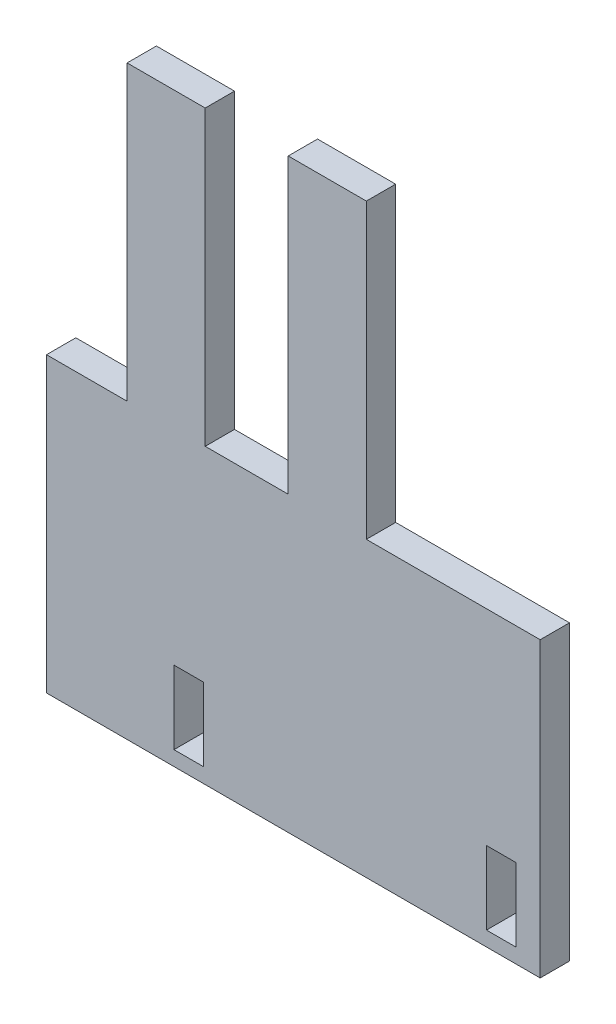
ISO-10303-21;
HEADER;
FILE_DESCRIPTION(('STEP AP214'),'2;1');
FILE_NAME('part.step','',(''),(''),'','','');
FILE_SCHEMA(('AUTOMOTIVE_DESIGN { 1 0 10303 214 1 1 1 1 }'));
ENDSEC;
DATA;
#1=APPLICATION_CONTEXT('core data for automotive mechanical design processes');
#2=APPLICATION_PROTOCOL_DEFINITION('international standard','automotive_design',2000,#1);
#3=PRODUCT_CONTEXT('',#1,'mechanical');
#4=PRODUCT('Part','Part','',(#3));
#5=PRODUCT_RELATED_PRODUCT_CATEGORY('part','',(#4));
#6=PRODUCT_DEFINITION_FORMATION('','',#4);
#7=PRODUCT_DEFINITION_CONTEXT('part definition',#1,'design');
#8=PRODUCT_DEFINITION('design','',#6,#7);
#9=PRODUCT_DEFINITION_SHAPE('','',#8);
#10=(LENGTH_UNIT() NAMED_UNIT(*) SI_UNIT(.MILLI.,.METRE.));
#11=(NAMED_UNIT(*) PLANE_ANGLE_UNIT() SI_UNIT($,.RADIAN.));
#12=(NAMED_UNIT(*) SI_UNIT($,.STERADIAN.) SOLID_ANGLE_UNIT());
#13=UNCERTAINTY_MEASURE_WITH_UNIT(LENGTH_MEASURE(1.E-05),#10,'distance_accuracy_value','');
#14=(GEOMETRIC_REPRESENTATION_CONTEXT(3) GLOBAL_UNCERTAINTY_ASSIGNED_CONTEXT((#13)) GLOBAL_UNIT_ASSIGNED_CONTEXT((#10,
#11,#12)) REPRESENTATION_CONTEXT('',''));
#15=CARTESIAN_POINT('',(0.,0.,0.));
#16=DIRECTION('',(0.,0.,1.));
#17=DIRECTION('',(1.,0.,0.));
#18=AXIS2_PLACEMENT_3D('',#15,#16,#17);
#19=CARTESIAN_POINT('',(0.,0.,6.));
#20=DIRECTION('',(0.,0.,1.));
#21=DIRECTION('',(1.,0.,0.));
#22=AXIS2_PLACEMENT_3D('',#19,#20,#21);
#23=PLANE('',#22);
#24=DIRECTION('',(-1.,0.,0.));
#25=VECTOR('',#24,1.);
#26=CARTESIAN_POINT('',(-42.4324162415231,-12.6187150837989,6.));
#27=LINE('',#26,#25);
#28=CARTESIAN_POINT('',(-42.4324162415231,-12.6187150837989,6.));
#29=VERTEX_POINT('',#28);
#30=CARTESIAN_POINT('',(-58.9324162415231,-12.6187150837989,6.));
#31=VERTEX_POINT('',#30);
#32=EDGE_CURVE('E237',#29,#31,#27,.T.);
#33=ORIENTED_EDGE('',*,*,#32,.T.);
#34=DIRECTION('',(0.,-1.,0.));
#35=VECTOR('',#34,1.);
#36=CARTESIAN_POINT('',(-58.9324162415231,-12.6187150837989,6.));
#37=LINE('',#36,#35);
#38=CARTESIAN_POINT('',(-58.9324162415231,-72.6187150837989,6.));
#39=VERTEX_POINT('',#38);
#40=EDGE_CURVE('E240',#31,#39,#37,.T.);
#41=ORIENTED_EDGE('',*,*,#40,.T.);
#42=DIRECTION('',(1.,0.,0.));
#43=VECTOR('',#42,1.);
#44=CARTESIAN_POINT('',(-58.9324162415231,-72.6187150837989,6.));
#45=LINE('',#44,#43);
#46=CARTESIAN_POINT('',(42.1675837584769,-72.6187150837989,6.));
#47=VERTEX_POINT('',#46);
#48=EDGE_CURVE('E243',#39,#47,#45,.T.);
#49=ORIENTED_EDGE('',*,*,#48,.T.);
#50=DIRECTION('',(0.,1.,0.));
#51=VECTOR('',#50,1.);
#52=CARTESIAN_POINT('',(42.1675837584769,-72.6187150837989,6.));
#53=LINE('',#52,#51);
#54=CARTESIAN_POINT('',(42.1675837584769,-12.6187150837989,6.));
#55=VERTEX_POINT('',#54);
#56=EDGE_CURVE('E245',#47,#55,#53,.T.);
#57=ORIENTED_EDGE('',*,*,#56,.T.);
#58=DIRECTION('',(-1.,0.,0.));
#59=VECTOR('',#58,1.);
#60=CARTESIAN_POINT('',(42.1675837584769,-12.6187150837989,6.));
#61=LINE('',#60,#59);
#62=CARTESIAN_POINT('',(6.56758375847687,-12.6187150837989,6.));
#63=VERTEX_POINT('',#62);
#64=EDGE_CURVE('E247',#55,#63,#61,.T.);
#65=ORIENTED_EDGE('',*,*,#64,.T.);
#66=DIRECTION('',(0.,1.,0.));
#67=VECTOR('',#66,1.);
#68=CARTESIAN_POINT('',(6.56758375847687,-12.6187150837989,6.));
#69=LINE('',#68,#67);
#70=CARTESIAN_POINT('',(6.56758375847687,47.3812849162011,6.));
#71=VERTEX_POINT('',#70);
#72=EDGE_CURVE('E249',#63,#71,#69,.T.);
#73=ORIENTED_EDGE('',*,*,#72,.T.);
#74=DIRECTION('',(-1.,0.,0.));
#75=VECTOR('',#74,1.);
#76=CARTESIAN_POINT('',(6.56758375847687,47.3812849162011,6.));
#77=LINE('',#76,#75);
#78=CARTESIAN_POINT('',(-9.43241624152313,47.3812849162011,6.));
#79=VERTEX_POINT('',#78);
#80=EDGE_CURVE('E251',#71,#79,#77,.T.);
#81=ORIENTED_EDGE('',*,*,#80,.T.);
#82=DIRECTION('',(0.,-1.,0.));
#83=VECTOR('',#82,1.);
#84=CARTESIAN_POINT('',(-9.43241624152313,47.3812849162011,6.));
#85=LINE('',#84,#83);
#86=CARTESIAN_POINT('',(-9.43241624152312,-12.6187150837989,6.));
#87=VERTEX_POINT('',#86);
#88=EDGE_CURVE('E253',#79,#87,#85,.T.);
#89=ORIENTED_EDGE('',*,*,#88,.T.);
#90=DIRECTION('',(-1.,0.,0.));
#91=VECTOR('',#90,1.);
#92=CARTESIAN_POINT('',(-9.43241624152312,-12.6187150837989,6.));
#93=LINE('',#92,#91);
#94=CARTESIAN_POINT('',(-26.4324162415231,-12.6187150837989,6.));
#95=VERTEX_POINT('',#94);
#96=EDGE_CURVE('E255',#87,#95,#93,.T.);
#97=ORIENTED_EDGE('',*,*,#96,.T.);
#98=DIRECTION('',(0.,1.,0.));
#99=VECTOR('',#98,1.);
#100=CARTESIAN_POINT('',(-26.4324162415231,-12.6187150837989,6.));
#101=LINE('',#100,#99);
#102=CARTESIAN_POINT('',(-26.4324162415231,47.3812849162011,6.));
#103=VERTEX_POINT('',#102);
#104=EDGE_CURVE('E257',#95,#103,#101,.T.);
#105=ORIENTED_EDGE('',*,*,#104,.T.);
#106=DIRECTION('',(-1.,0.,0.));
#107=VECTOR('',#106,1.);
#108=CARTESIAN_POINT('',(-26.4324162415231,47.3812849162011,6.));
#109=LINE('',#108,#107);
#110=CARTESIAN_POINT('',(-42.4324162415231,47.3812849162011,6.));
#111=VERTEX_POINT('',#110);
#112=EDGE_CURVE('E259',#103,#111,#109,.T.);
#113=ORIENTED_EDGE('',*,*,#112,.T.);
#114=DIRECTION('',(0.,-1.,0.));
#115=VECTOR('',#114,1.);
#116=CARTESIAN_POINT('',(-42.4324162415231,47.3812849162011,6.));
#117=LINE('',#116,#115);
#118=EDGE_CURVE('E261',#111,#29,#117,.T.);
#119=ORIENTED_EDGE('',*,*,#118,.T.);
#120=EDGE_LOOP('',(#33,#41,#49,#57,#65,#73,#81,#89,#97,#105,#113,#119));
#121=FACE_BOUND('',#120,.T.);
#122=DIRECTION('',(-1.,0.,0.));
#123=VECTOR('',#122,1.);
#124=CARTESIAN_POINT('',(37.1675837584769,-54.6187150837989,6.));
#125=LINE('',#124,#123);
#126=CARTESIAN_POINT('',(37.1675837584769,-54.6187150837989,6.));
#127=VERTEX_POINT('',#126);
#128=CARTESIAN_POINT('',(31.1675837584769,-54.6187150837989,6.));
#129=VERTEX_POINT('',#128);
#130=EDGE_CURVE('E208',#127,#129,#125,.T.);
#131=ORIENTED_EDGE('',*,*,#130,.F.);
#132=DIRECTION('',(0.,1.,0.));
#133=VECTOR('',#132,1.);
#134=CARTESIAN_POINT('',(37.1675837584769,-54.6187150837989,6.));
#135=LINE('',#134,#133);
#136=CARTESIAN_POINT('',(37.1675837584769,-69.6187150837989,6.));
#137=VERTEX_POINT('',#136);
#138=EDGE_CURVE('E206',#137,#127,#135,.T.);
#139=ORIENTED_EDGE('',*,*,#138,.F.);
#140=DIRECTION('',(1.,0.,0.));
#141=VECTOR('',#140,1.);
#142=CARTESIAN_POINT('',(37.1675837584769,-69.6187150837989,6.));
#143=LINE('',#142,#141);
#144=CARTESIAN_POINT('',(31.1675837584769,-69.6187150837989,6.));
#145=VERTEX_POINT('',#144);
#146=EDGE_CURVE('E214',#145,#137,#143,.T.);
#147=ORIENTED_EDGE('',*,*,#146,.F.);
#148=DIRECTION('',(0.,-1.,0.));
#149=VECTOR('',#148,1.);
#150=CARTESIAN_POINT('',(31.1675837584769,-54.6187150837989,6.));
#151=LINE('',#150,#149);
#152=EDGE_CURVE('E211',#129,#145,#151,.T.);
#153=ORIENTED_EDGE('',*,*,#152,.F.);
#154=EDGE_LOOP('',(#131,#139,#147,#153));
#155=FACE_BOUND('',#154,.T.);
#156=DIRECTION('',(-1.,0.,0.));
#157=VECTOR('',#156,1.);
#158=CARTESIAN_POINT('',(-26.8324162415231,-54.6187150837989,6.));
#159=LINE('',#158,#157);
#160=CARTESIAN_POINT('',(-26.8324162415231,-54.6187150837989,6.));
#161=VERTEX_POINT('',#160);
#162=CARTESIAN_POINT('',(-32.8324162415231,-54.6187150837989,6.));
#163=VERTEX_POINT('',#162);
#164=EDGE_CURVE('E178',#161,#163,#159,.T.);
#165=ORIENTED_EDGE('',*,*,#164,.F.);
#166=DIRECTION('',(0.,1.,0.));
#167=VECTOR('',#166,1.);
#168=CARTESIAN_POINT('',(-26.8324162415231,-54.6187150837989,6.));
#169=LINE('',#168,#167);
#170=CARTESIAN_POINT('',(-26.8324162415231,-69.6187150837989,6.));
#171=VERTEX_POINT('',#170);
#172=EDGE_CURVE('E170',#171,#161,#169,.T.);
#173=ORIENTED_EDGE('',*,*,#172,.F.);
#174=DIRECTION('',(1.,0.,0.));
#175=VECTOR('',#174,1.);
#176=CARTESIAN_POINT('',(-26.8324162415231,-69.6187150837989,6.));
#177=LINE('',#176,#175);
#178=CARTESIAN_POINT('',(-32.8324162415231,-69.6187150837989,6.));
#179=VERTEX_POINT('',#178);
#180=EDGE_CURVE('E192',#179,#171,#177,.T.);
#181=ORIENTED_EDGE('',*,*,#180,.F.);
#182=DIRECTION('',(0.,-1.,0.));
#183=VECTOR('',#182,1.);
#184=CARTESIAN_POINT('',(-32.8324162415231,-54.6187150837989,6.));
#185=LINE('',#184,#183);
#186=EDGE_CURVE('E190',#163,#179,#185,.T.);
#187=ORIENTED_EDGE('',*,*,#186,.F.);
#188=EDGE_LOOP('',(#165,#173,#181,#187));
#189=FACE_BOUND('',#188,.T.);
#190=ADVANCED_FACE('F33',(#121,#155,#189),#23,.T.);
#191=CARTESIAN_POINT('',(0.,0.,0.));
#192=DIRECTION('',(0.,0.,1.));
#193=DIRECTION('',(1.,0.,0.));
#194=AXIS2_PLACEMENT_3D('',#191,#192,#193);
#195=PLANE('',#194);
#196=DIRECTION('',(0.,1.,0.));
#197=VECTOR('',#196,1.);
#198=CARTESIAN_POINT('',(37.1675837584769,-54.6187150837989,0.));
#199=LINE('',#198,#197);
#200=CARTESIAN_POINT('',(37.1675837584769,-69.6187150837989,0.));
#201=VERTEX_POINT('',#200);
#202=CARTESIAN_POINT('',(37.1675837584769,-54.6187150837989,0.));
#203=VERTEX_POINT('',#202);
#204=EDGE_CURVE('E186',#201,#203,#199,.T.);
#205=ORIENTED_EDGE('',*,*,#204,.T.);
#206=DIRECTION('',(-1.,0.,0.));
#207=VECTOR('',#206,1.);
#208=CARTESIAN_POINT('',(37.1675837584769,-54.6187150837989,0.));
#209=LINE('',#208,#207);
#210=CARTESIAN_POINT('',(31.1675837584769,-54.6187150837989,0.));
#211=VERTEX_POINT('',#210);
#212=EDGE_CURVE('E219',#203,#211,#209,.T.);
#213=ORIENTED_EDGE('',*,*,#212,.T.);
#214=DIRECTION('',(0.,-1.,0.));
#215=VECTOR('',#214,1.);
#216=CARTESIAN_POINT('',(31.1675837584769,-54.6187150837989,0.));
#217=LINE('',#216,#215);
#218=CARTESIAN_POINT('',(31.1675837584769,-69.6187150837989,0.));
#219=VERTEX_POINT('',#218);
#220=EDGE_CURVE('E222',#211,#219,#217,.T.);
#221=ORIENTED_EDGE('',*,*,#220,.T.);
#222=DIRECTION('',(1.,0.,0.));
#223=VECTOR('',#222,1.);
#224=CARTESIAN_POINT('',(37.1675837584769,-69.6187150837989,0.));
#225=LINE('',#224,#223);
#226=EDGE_CURVE('E209',#219,#201,#225,.T.);
#227=ORIENTED_EDGE('',*,*,#226,.T.);
#228=EDGE_LOOP('',(#205,#213,#221,#227));
#229=FACE_BOUND('',#228,.T.);
#230=DIRECTION('',(-1.,0.,0.));
#231=VECTOR('',#230,1.);
#232=CARTESIAN_POINT('',(-42.4324162415231,-12.6187150837989,0.));
#233=LINE('',#232,#231);
#234=CARTESIAN_POINT('',(-42.4324162415231,-12.6187150837989,0.));
#235=VERTEX_POINT('',#234);
#236=CARTESIAN_POINT('',(-58.9324162415231,-12.6187150837989,0.));
#237=VERTEX_POINT('',#236);
#238=EDGE_CURVE('E236',#235,#237,#233,.T.);
#239=ORIENTED_EDGE('',*,*,#238,.F.);
#240=DIRECTION('',(0.,-1.,0.));
#241=VECTOR('',#240,1.);
#242=CARTESIAN_POINT('',(-42.4324162415231,47.3812849162011,0.));
#243=LINE('',#242,#241);
#244=CARTESIAN_POINT('',(-42.4324162415231,47.3812849162011,0.));
#245=VERTEX_POINT('',#244);
#246=EDGE_CURVE('E241',#245,#235,#243,.T.);
#247=ORIENTED_EDGE('',*,*,#246,.F.);
#248=DIRECTION('',(-1.,0.,0.));
#249=VECTOR('',#248,1.);
#250=CARTESIAN_POINT('',(-26.4324162415231,47.3812849162011,0.));
#251=LINE('',#250,#249);
#252=CARTESIAN_POINT('',(-26.4324162415231,47.3812849162011,0.));
#253=VERTEX_POINT('',#252);
#254=EDGE_CURVE('E284',#253,#245,#251,.T.);
#255=ORIENTED_EDGE('',*,*,#254,.F.);
#256=DIRECTION('',(0.,1.,0.));
#257=VECTOR('',#256,1.);
#258=CARTESIAN_POINT('',(-26.4324162415231,-12.6187150837989,0.));
#259=LINE('',#258,#257);
#260=CARTESIAN_POINT('',(-26.4324162415231,-12.6187150837989,0.));
#261=VERTEX_POINT('',#260);
#262=EDGE_CURVE('E282',#261,#253,#259,.T.);
#263=ORIENTED_EDGE('',*,*,#262,.F.);
#264=DIRECTION('',(-1.,0.,0.));
#265=VECTOR('',#264,1.);
#266=CARTESIAN_POINT('',(-9.43241624152312,-12.6187150837989,0.));
#267=LINE('',#266,#265);
#268=CARTESIAN_POINT('',(-9.43241624152312,-12.6187150837989,0.));
#269=VERTEX_POINT('',#268);
#270=EDGE_CURVE('E280',#269,#261,#267,.T.);
#271=ORIENTED_EDGE('',*,*,#270,.F.);
#272=DIRECTION('',(0.,-1.,0.));
#273=VECTOR('',#272,1.);
#274=CARTESIAN_POINT('',(-9.43241624152313,47.3812849162011,0.));
#275=LINE('',#274,#273);
#276=CARTESIAN_POINT('',(-9.43241624152313,47.3812849162011,0.));
#277=VERTEX_POINT('',#276);
#278=EDGE_CURVE('E278',#277,#269,#275,.T.);
#279=ORIENTED_EDGE('',*,*,#278,.F.);
#280=DIRECTION('',(-1.,0.,0.));
#281=VECTOR('',#280,1.);
#282=CARTESIAN_POINT('',(6.56758375847687,47.3812849162011,0.));
#283=LINE('',#282,#281);
#284=CARTESIAN_POINT('',(6.56758375847687,47.3812849162011,0.));
#285=VERTEX_POINT('',#284);
#286=EDGE_CURVE('E276',#285,#277,#283,.T.);
#287=ORIENTED_EDGE('',*,*,#286,.F.);
#288=DIRECTION('',(0.,1.,0.));
#289=VECTOR('',#288,1.);
#290=CARTESIAN_POINT('',(6.56758375847687,-12.6187150837989,0.));
#291=LINE('',#290,#289);
#292=CARTESIAN_POINT('',(6.56758375847687,-12.6187150837989,0.));
#293=VERTEX_POINT('',#292);
#294=EDGE_CURVE('E274',#293,#285,#291,.T.);
#295=ORIENTED_EDGE('',*,*,#294,.F.);
#296=DIRECTION('',(-1.,0.,0.));
#297=VECTOR('',#296,1.);
#298=CARTESIAN_POINT('',(42.1675837584769,-12.6187150837989,0.));
#299=LINE('',#298,#297);
#300=CARTESIAN_POINT('',(42.1675837584769,-12.6187150837989,0.));
#301=VERTEX_POINT('',#300);
#302=EDGE_CURVE('E272',#301,#293,#299,.T.);
#303=ORIENTED_EDGE('',*,*,#302,.F.);
#304=DIRECTION('',(0.,1.,0.));
#305=VECTOR('',#304,1.);
#306=CARTESIAN_POINT('',(42.1675837584769,-72.6187150837989,0.));
#307=LINE('',#306,#305);
#308=CARTESIAN_POINT('',(42.1675837584769,-72.6187150837989,0.));
#309=VERTEX_POINT('',#308);
#310=EDGE_CURVE('E270',#309,#301,#307,.T.);
#311=ORIENTED_EDGE('',*,*,#310,.F.);
#312=DIRECTION('',(1.,0.,0.));
#313=VECTOR('',#312,1.);
#314=CARTESIAN_POINT('',(-58.9324162415231,-72.6187150837989,0.));
#315=LINE('',#314,#313);
#316=CARTESIAN_POINT('',(-58.9324162415231,-72.6187150837989,0.));
#317=VERTEX_POINT('',#316);
#318=EDGE_CURVE('E268',#317,#309,#315,.T.);
#319=ORIENTED_EDGE('',*,*,#318,.F.);
#320=DIRECTION('',(0.,-1.,0.));
#321=VECTOR('',#320,1.);
#322=CARTESIAN_POINT('',(-58.9324162415231,-12.6187150837989,0.));
#323=LINE('',#322,#321);
#324=EDGE_CURVE('E266',#237,#317,#323,.T.);
#325=ORIENTED_EDGE('',*,*,#324,.F.);
#326=EDGE_LOOP('',(#239,#247,#255,#263,#271,#279,#287,#295,#303,#311,#319,#325));
#327=FACE_BOUND('',#326,.T.);
#328=DIRECTION('',(0.,1.,0.));
#329=VECTOR('',#328,1.);
#330=CARTESIAN_POINT('',(-26.8324162415231,-54.6187150837989,0.));
#331=LINE('',#330,#329);
#332=CARTESIAN_POINT('',(-26.8324162415231,-69.6187150837989,0.));
#333=VERTEX_POINT('',#332);
#334=CARTESIAN_POINT('',(-26.8324162415231,-54.6187150837989,0.));
#335=VERTEX_POINT('',#334);
#336=EDGE_CURVE('E56',#333,#335,#331,.T.);
#337=ORIENTED_EDGE('',*,*,#336,.T.);
#338=DIRECTION('',(-1.,0.,0.));
#339=VECTOR('',#338,1.);
#340=CARTESIAN_POINT('',(-26.8324162415231,-54.6187150837989,0.));
#341=LINE('',#340,#339);
#342=CARTESIAN_POINT('',(-32.8324162415231,-54.6187150837989,0.));
#343=VERTEX_POINT('',#342);
#344=EDGE_CURVE('E185',#335,#343,#341,.T.);
#345=ORIENTED_EDGE('',*,*,#344,.T.);
#346=DIRECTION('',(0.,-1.,0.));
#347=VECTOR('',#346,1.);
#348=CARTESIAN_POINT('',(-32.8324162415231,-54.6187150837989,0.));
#349=LINE('',#348,#347);
#350=CARTESIAN_POINT('',(-32.8324162415231,-69.6187150837989,0.));
#351=VERTEX_POINT('',#350);
#352=EDGE_CURVE('E198',#343,#351,#349,.T.);
#353=ORIENTED_EDGE('',*,*,#352,.T.);
#354=DIRECTION('',(1.,0.,0.));
#355=VECTOR('',#354,1.);
#356=CARTESIAN_POINT('',(-26.8324162415231,-69.6187150837989,0.));
#357=LINE('',#356,#355);
#358=EDGE_CURVE('E179',#351,#333,#357,.T.);
#359=ORIENTED_EDGE('',*,*,#358,.T.);
#360=EDGE_LOOP('',(#337,#345,#353,#359));
#361=FACE_BOUND('',#360,.T.);
#362=ADVANCED_FACE('F326',(#229,#327,#361),#195,.F.);
#363=CARTESIAN_POINT('',(-42.4324162415231,-12.6187150837989,6.));
#364=DIRECTION('',(0.,-1.,0.));
#365=DIRECTION('',(1.,0.,0.));
#366=AXIS2_PLACEMENT_3D('',#363,#364,#365);
#367=PLANE('',#366);
#368=ORIENTED_EDGE('',*,*,#238,.T.);
#369=DIRECTION('',(0.,0.,-1.));
#370=VECTOR('',#369,1.);
#371=CARTESIAN_POINT('',(-58.9324162415231,-12.6187150837989,6.));
#372=LINE('',#371,#370);
#373=EDGE_CURVE('E11',#31,#237,#372,.T.);
#374=ORIENTED_EDGE('',*,*,#373,.F.);
#375=ORIENTED_EDGE('',*,*,#32,.F.);
#376=DIRECTION('',(0.,0.,-1.));
#377=VECTOR('',#376,1.);
#378=CARTESIAN_POINT('',(-42.4324162415231,-12.6187150837989,6.));
#379=LINE('',#378,#377);
#380=EDGE_CURVE('E263',#29,#235,#379,.T.);
#381=ORIENTED_EDGE('',*,*,#380,.T.);
#382=EDGE_LOOP('',(#368,#374,#375,#381));
#383=FACE_BOUND('',#382,.T.);
#384=ADVANCED_FACE('F35',(#383),#367,.F.);
#385=CARTESIAN_POINT('',(-58.9324162415231,-12.6187150837989,6.));
#386=DIRECTION('',(1.,0.,0.));
#387=DIRECTION('',(0.,1.,0.));
#388=AXIS2_PLACEMENT_3D('',#385,#386,#387);
#389=PLANE('',#388);
#390=ORIENTED_EDGE('',*,*,#324,.T.);
#391=DIRECTION('',(0.,0.,-1.));
#392=VECTOR('',#391,1.);
#393=CARTESIAN_POINT('',(-58.9324162415231,-72.6187150837989,6.));
#394=LINE('',#393,#392);
#395=EDGE_CURVE('E41',#39,#317,#394,.T.);
#396=ORIENTED_EDGE('',*,*,#395,.F.);
#397=ORIENTED_EDGE('',*,*,#40,.F.);
#398=ORIENTED_EDGE('',*,*,#373,.T.);
#399=EDGE_LOOP('',(#390,#396,#397,#398));
#400=FACE_BOUND('',#399,.T.);
#401=ADVANCED_FACE('F344',(#400),#389,.F.);
#402=CARTESIAN_POINT('',(-58.9324162415231,-72.6187150837989,6.));
#403=DIRECTION('',(0.,1.,0.));
#404=DIRECTION('',(0.,0.,1.));
#405=AXIS2_PLACEMENT_3D('',#402,#403,#404);
#406=PLANE('',#405);
#407=ORIENTED_EDGE('',*,*,#318,.T.);
#408=DIRECTION('',(0.,0.,-1.));
#409=VECTOR('',#408,1.);
#410=CARTESIAN_POINT('',(42.1675837584769,-72.6187150837989,6.));
#411=LINE('',#410,#409);
#412=EDGE_CURVE('E313',#47,#309,#411,.T.);
#413=ORIENTED_EDGE('',*,*,#412,.F.);
#414=ORIENTED_EDGE('',*,*,#48,.F.);
#415=ORIENTED_EDGE('',*,*,#395,.T.);
#416=EDGE_LOOP('',(#407,#413,#414,#415));
#417=FACE_BOUND('',#416,.T.);
#418=ADVANCED_FACE('F320',(#417),#406,.F.);
#419=CARTESIAN_POINT('',(42.1675837584769,-72.6187150837989,6.));
#420=DIRECTION('',(-1.,0.,0.));
#421=DIRECTION('',(0.,0.,1.));
#422=AXIS2_PLACEMENT_3D('',#419,#420,#421);
#423=PLANE('',#422);
#424=ORIENTED_EDGE('',*,*,#310,.T.);
#425=DIRECTION('',(0.,0.,-1.));
#426=VECTOR('',#425,1.);
#427=CARTESIAN_POINT('',(42.1675837584769,-12.6187150837989,6.));
#428=LINE('',#427,#426);
#429=EDGE_CURVE('E310',#55,#301,#428,.T.);
#430=ORIENTED_EDGE('',*,*,#429,.F.);
#431=ORIENTED_EDGE('',*,*,#56,.F.);
#432=ORIENTED_EDGE('',*,*,#412,.T.);
#433=EDGE_LOOP('',(#424,#430,#431,#432));
#434=FACE_BOUND('',#433,.T.);
#435=ADVANCED_FACE('F332',(#434),#423,.F.);
#436=CARTESIAN_POINT('',(42.1675837584769,-12.6187150837989,6.));
#437=DIRECTION('',(0.,-1.,0.));
#438=DIRECTION('',(1.,0.,0.));
#439=AXIS2_PLACEMENT_3D('',#436,#437,#438);
#440=PLANE('',#439);
#441=ORIENTED_EDGE('',*,*,#302,.T.);
#442=DIRECTION('',(0.,0.,-1.));
#443=VECTOR('',#442,1.);
#444=CARTESIAN_POINT('',(6.56758375847687,-12.6187150837989,6.));
#445=LINE('',#444,#443);
#446=EDGE_CURVE('E307',#63,#293,#445,.T.);
#447=ORIENTED_EDGE('',*,*,#446,.F.);
#448=ORIENTED_EDGE('',*,*,#64,.F.);
#449=ORIENTED_EDGE('',*,*,#429,.T.);
#450=EDGE_LOOP('',(#441,#447,#448,#449));
#451=FACE_BOUND('',#450,.T.);
#452=ADVANCED_FACE('F336',(#451),#440,.F.);
#453=CARTESIAN_POINT('',(6.56758375847687,-12.6187150837989,6.));
#454=DIRECTION('',(-1.,0.,0.));
#455=DIRECTION('',(0.,0.,1.));
#456=AXIS2_PLACEMENT_3D('',#453,#454,#455);
#457=PLANE('',#456);
#458=ORIENTED_EDGE('',*,*,#294,.T.);
#459=DIRECTION('',(0.,0.,-1.));
#460=VECTOR('',#459,1.);
#461=CARTESIAN_POINT('',(6.56758375847687,47.3812849162011,6.));
#462=LINE('',#461,#460);
#463=EDGE_CURVE('E304',#71,#285,#462,.T.);
#464=ORIENTED_EDGE('',*,*,#463,.F.);
#465=ORIENTED_EDGE('',*,*,#72,.F.);
#466=ORIENTED_EDGE('',*,*,#446,.T.);
#467=EDGE_LOOP('',(#458,#464,#465,#466));
#468=FACE_BOUND('',#467,.T.);
#469=ADVANCED_FACE('F377',(#468),#457,.F.);
#470=CARTESIAN_POINT('',(6.56758375847687,47.3812849162011,6.));
#471=DIRECTION('',(0.,-1.,0.));
#472=DIRECTION('',(0.,0.,-1.));
#473=AXIS2_PLACEMENT_3D('',#470,#471,#472);
#474=PLANE('',#473);
#475=ORIENTED_EDGE('',*,*,#286,.T.);
#476=DIRECTION('',(0.,0.,-1.));
#477=VECTOR('',#476,1.);
#478=CARTESIAN_POINT('',(-9.43241624152313,47.3812849162011,6.));
#479=LINE('',#478,#477);
#480=EDGE_CURVE('E301',#79,#277,#479,.T.);
#481=ORIENTED_EDGE('',*,*,#480,.F.);
#482=ORIENTED_EDGE('',*,*,#80,.F.);
#483=ORIENTED_EDGE('',*,*,#463,.T.);
#484=EDGE_LOOP('',(#475,#481,#482,#483));
#485=FACE_BOUND('',#484,.T.);
#486=ADVANCED_FACE('F375',(#485),#474,.F.);
#487=CARTESIAN_POINT('',(-9.43241624152313,47.3812849162011,6.));
#488=DIRECTION('',(1.,0.,0.));
#489=DIRECTION('',(0.,1.,0.));
#490=AXIS2_PLACEMENT_3D('',#487,#488,#489);
#491=PLANE('',#490);
#492=ORIENTED_EDGE('',*,*,#278,.T.);
#493=DIRECTION('',(0.,0.,-1.));
#494=VECTOR('',#493,1.);
#495=CARTESIAN_POINT('',(-9.43241624152312,-12.6187150837989,6.));
#496=LINE('',#495,#494);
#497=EDGE_CURVE('E298',#87,#269,#496,.T.);
#498=ORIENTED_EDGE('',*,*,#497,.F.);
#499=ORIENTED_EDGE('',*,*,#88,.F.);
#500=ORIENTED_EDGE('',*,*,#480,.T.);
#501=EDGE_LOOP('',(#492,#498,#499,#500));
#502=FACE_BOUND('',#501,.T.);
#503=ADVANCED_FACE('F371',(#502),#491,.F.);
#504=CARTESIAN_POINT('',(-9.43241624152312,-12.6187150837989,6.));
#505=DIRECTION('',(0.,-1.,0.));
#506=DIRECTION('',(1.,0.,0.));
#507=AXIS2_PLACEMENT_3D('',#504,#505,#506);
#508=PLANE('',#507);
#509=ORIENTED_EDGE('',*,*,#270,.T.);
#510=DIRECTION('',(0.,0.,-1.));
#511=VECTOR('',#510,1.);
#512=CARTESIAN_POINT('',(-26.4324162415231,-12.6187150837989,6.));
#513=LINE('',#512,#511);
#514=EDGE_CURVE('E295',#95,#261,#513,.T.);
#515=ORIENTED_EDGE('',*,*,#514,.F.);
#516=ORIENTED_EDGE('',*,*,#96,.F.);
#517=ORIENTED_EDGE('',*,*,#497,.T.);
#518=EDGE_LOOP('',(#509,#515,#516,#517));
#519=FACE_BOUND('',#518,.T.);
#520=ADVANCED_FACE('F366',(#519),#508,.F.);
#521=CARTESIAN_POINT('',(-26.4324162415231,-12.6187150837989,6.));
#522=DIRECTION('',(-1.,0.,0.));
#523=DIRECTION('',(0.,-1.,0.));
#524=AXIS2_PLACEMENT_3D('',#521,#522,#523);
#525=PLANE('',#524);
#526=ORIENTED_EDGE('',*,*,#262,.T.);
#527=DIRECTION('',(0.,0.,-1.));
#528=VECTOR('',#527,1.);
#529=CARTESIAN_POINT('',(-26.4324162415231,47.3812849162011,6.));
#530=LINE('',#529,#528);
#531=EDGE_CURVE('E292',#103,#253,#530,.T.);
#532=ORIENTED_EDGE('',*,*,#531,.F.);
#533=ORIENTED_EDGE('',*,*,#104,.F.);
#534=ORIENTED_EDGE('',*,*,#514,.T.);
#535=EDGE_LOOP('',(#526,#532,#533,#534));
#536=FACE_BOUND('',#535,.T.);
#537=ADVANCED_FACE('F360',(#536),#525,.F.);
#538=CARTESIAN_POINT('',(-26.4324162415231,47.3812849162011,6.));
#539=DIRECTION('',(0.,-1.,0.));
#540=DIRECTION('',(0.,0.,-1.));
#541=AXIS2_PLACEMENT_3D('',#538,#539,#540);
#542=PLANE('',#541);
#543=ORIENTED_EDGE('',*,*,#254,.T.);
#544=DIRECTION('',(0.,0.,-1.));
#545=VECTOR('',#544,1.);
#546=CARTESIAN_POINT('',(-42.4324162415231,47.3812849162011,6.));
#547=LINE('',#546,#545);
#548=EDGE_CURVE('E289',#111,#245,#547,.T.);
#549=ORIENTED_EDGE('',*,*,#548,.F.);
#550=ORIENTED_EDGE('',*,*,#112,.F.);
#551=ORIENTED_EDGE('',*,*,#531,.T.);
#552=EDGE_LOOP('',(#543,#549,#550,#551));
#553=FACE_BOUND('',#552,.T.);
#554=ADVANCED_FACE('F356',(#553),#542,.F.);
#555=CARTESIAN_POINT('',(-42.4324162415231,47.3812849162011,6.));
#556=DIRECTION('',(1.,0.,0.));
#557=DIRECTION('',(0.,1.,0.));
#558=AXIS2_PLACEMENT_3D('',#555,#556,#557);
#559=PLANE('',#558);
#560=ORIENTED_EDGE('',*,*,#246,.T.);
#561=ORIENTED_EDGE('',*,*,#380,.F.);
#562=ORIENTED_EDGE('',*,*,#118,.F.);
#563=ORIENTED_EDGE('',*,*,#548,.T.);
#564=EDGE_LOOP('',(#560,#561,#562,#563));
#565=FACE_BOUND('',#564,.T.);
#566=ADVANCED_FACE('F351',(#565),#559,.F.);
#567=CARTESIAN_POINT('',(37.1675837584769,-54.6187150837989,6.));
#568=DIRECTION('',(-1.,0.,0.));
#569=DIRECTION('',(0.,0.,1.));
#570=AXIS2_PLACEMENT_3D('',#567,#568,#569);
#571=PLANE('',#570);
#572=ORIENTED_EDGE('',*,*,#204,.F.);
#573=DIRECTION('',(0.,0.,-1.));
#574=VECTOR('',#573,1.);
#575=CARTESIAN_POINT('',(37.1675837584769,-69.6187150837989,6.));
#576=LINE('',#575,#574);
#577=EDGE_CURVE('E216',#137,#201,#576,.T.);
#578=ORIENTED_EDGE('',*,*,#577,.F.);
#579=ORIENTED_EDGE('',*,*,#138,.T.);
#580=DIRECTION('',(0.,0.,-1.));
#581=VECTOR('',#580,1.);
#582=CARTESIAN_POINT('',(37.1675837584769,-54.6187150837989,6.));
#583=LINE('',#582,#581);
#584=EDGE_CURVE('E233',#127,#203,#583,.T.);
#585=ORIENTED_EDGE('',*,*,#584,.T.);
#586=EDGE_LOOP('',(#572,#578,#579,#585));
#587=FACE_BOUND('',#586,.T.);
#588=ADVANCED_FACE('F394',(#587),#571,.T.);
#589=CARTESIAN_POINT('',(37.1675837584769,-54.6187150837989,6.));
#590=DIRECTION('',(0.,-1.,0.));
#591=DIRECTION('',(0.,0.,-1.));
#592=AXIS2_PLACEMENT_3D('',#589,#590,#591);
#593=PLANE('',#592);
#594=ORIENTED_EDGE('',*,*,#212,.F.);
#595=ORIENTED_EDGE('',*,*,#584,.F.);
#596=ORIENTED_EDGE('',*,*,#130,.T.);
#597=DIRECTION('',(0.,0.,-1.));
#598=VECTOR('',#597,1.);
#599=CARTESIAN_POINT('',(31.1675837584769,-54.6187150837989,6.));
#600=LINE('',#599,#598);
#601=EDGE_CURVE('E231',#129,#211,#600,.T.);
#602=ORIENTED_EDGE('',*,*,#601,.T.);
#603=EDGE_LOOP('',(#594,#595,#596,#602));
#604=FACE_BOUND('',#603,.T.);
#605=ADVANCED_FACE('F432',(#604),#593,.T.);
#606=CARTESIAN_POINT('',(31.1675837584769,-54.6187150837989,6.));
#607=DIRECTION('',(1.,0.,0.));
#608=DIRECTION('',(0.,0.,-1.));
#609=AXIS2_PLACEMENT_3D('',#606,#607,#608);
#610=PLANE('',#609);
#611=ORIENTED_EDGE('',*,*,#220,.F.);
#612=ORIENTED_EDGE('',*,*,#601,.F.);
#613=ORIENTED_EDGE('',*,*,#152,.T.);
#614=DIRECTION('',(0.,0.,-1.));
#615=VECTOR('',#614,1.);
#616=CARTESIAN_POINT('',(31.1675837584769,-69.6187150837989,6.));
#617=LINE('',#616,#615);
#618=EDGE_CURVE('E229',#145,#219,#617,.T.);
#619=ORIENTED_EDGE('',*,*,#618,.T.);
#620=EDGE_LOOP('',(#611,#612,#613,#619));
#621=FACE_BOUND('',#620,.T.);
#622=ADVANCED_FACE('F439',(#621),#610,.T.);
#623=CARTESIAN_POINT('',(37.1675837584769,-69.6187150837989,6.));
#624=DIRECTION('',(0.,1.,0.));
#625=DIRECTION('',(0.,0.,1.));
#626=AXIS2_PLACEMENT_3D('',#623,#624,#625);
#627=PLANE('',#626);
#628=ORIENTED_EDGE('',*,*,#226,.F.);
#629=ORIENTED_EDGE('',*,*,#618,.F.);
#630=ORIENTED_EDGE('',*,*,#146,.T.);
#631=ORIENTED_EDGE('',*,*,#577,.T.);
#632=EDGE_LOOP('',(#628,#629,#630,#631));
#633=FACE_BOUND('',#632,.T.);
#634=ADVANCED_FACE('F446',(#633),#627,.T.);
#635=CARTESIAN_POINT('',(-26.8324162415231,-54.6187150837989,6.));
#636=DIRECTION('',(-1.,0.,0.));
#637=DIRECTION('',(0.,-1.,0.));
#638=AXIS2_PLACEMENT_3D('',#635,#636,#637);
#639=PLANE('',#638);
#640=ORIENTED_EDGE('',*,*,#336,.F.);
#641=DIRECTION('',(0.,0.,-1.));
#642=VECTOR('',#641,1.);
#643=CARTESIAN_POINT('',(-26.8324162415231,-69.6187150837989,6.));
#644=LINE('',#643,#642);
#645=EDGE_CURVE('E174',#171,#333,#644,.T.);
#646=ORIENTED_EDGE('',*,*,#645,.F.);
#647=ORIENTED_EDGE('',*,*,#172,.T.);
#648=DIRECTION('',(0.,0.,-1.));
#649=VECTOR('',#648,1.);
#650=CARTESIAN_POINT('',(-26.8324162415231,-54.6187150837989,6.));
#651=LINE('',#650,#649);
#652=EDGE_CURVE('E173',#161,#335,#651,.T.);
#653=ORIENTED_EDGE('',*,*,#652,.T.);
#654=EDGE_LOOP('',(#640,#646,#647,#653));
#655=FACE_BOUND('',#654,.T.);
#656=ADVANCED_FACE('F172',(#655),#639,.T.);
#657=CARTESIAN_POINT('',(-26.8324162415231,-54.6187150837989,6.));
#658=DIRECTION('',(0.,-1.,0.));
#659=DIRECTION('',(0.,0.,-1.));
#660=AXIS2_PLACEMENT_3D('',#657,#658,#659);
#661=PLANE('',#660);
#662=ORIENTED_EDGE('',*,*,#344,.F.);
#663=ORIENTED_EDGE('',*,*,#652,.F.);
#664=ORIENTED_EDGE('',*,*,#164,.T.);
#665=DIRECTION('',(0.,0.,-1.));
#666=VECTOR('',#665,1.);
#667=CARTESIAN_POINT('',(-32.8324162415231,-54.6187150837989,6.));
#668=LINE('',#667,#666);
#669=EDGE_CURVE('E187',#163,#343,#668,.T.);
#670=ORIENTED_EDGE('',*,*,#669,.T.);
#671=EDGE_LOOP('',(#662,#663,#664,#670));
#672=FACE_BOUND('',#671,.T.);
#673=ADVANCED_FACE('F182',(#672),#661,.T.);
#674=CARTESIAN_POINT('',(-32.8324162415231,-54.6187150837989,6.));
#675=DIRECTION('',(1.,0.,0.));
#676=DIRECTION('',(0.,0.,-1.));
#677=AXIS2_PLACEMENT_3D('',#674,#675,#676);
#678=PLANE('',#677);
#679=ORIENTED_EDGE('',*,*,#352,.F.);
#680=ORIENTED_EDGE('',*,*,#669,.F.);
#681=ORIENTED_EDGE('',*,*,#186,.T.);
#682=DIRECTION('',(0.,0.,-1.));
#683=VECTOR('',#682,1.);
#684=CARTESIAN_POINT('',(-32.8324162415231,-69.6187150837989,6.));
#685=LINE('',#684,#683);
#686=EDGE_CURVE('E48',#179,#351,#685,.T.);
#687=ORIENTED_EDGE('',*,*,#686,.T.);
#688=EDGE_LOOP('',(#679,#680,#681,#687));
#689=FACE_BOUND('',#688,.T.);
#690=ADVANCED_FACE('F467',(#689),#678,.T.);
#691=CARTESIAN_POINT('',(-26.8324162415231,-69.6187150837989,6.));
#692=DIRECTION('',(0.,1.,0.));
#693=DIRECTION('',(0.,0.,1.));
#694=AXIS2_PLACEMENT_3D('',#691,#692,#693);
#695=PLANE('',#694);
#696=ORIENTED_EDGE('',*,*,#358,.F.);
#697=ORIENTED_EDGE('',*,*,#686,.F.);
#698=ORIENTED_EDGE('',*,*,#180,.T.);
#699=ORIENTED_EDGE('',*,*,#645,.T.);
#700=EDGE_LOOP('',(#696,#697,#698,#699));
#701=FACE_BOUND('',#700,.T.);
#702=ADVANCED_FACE('F474',(#701),#695,.T.);
#703=CLOSED_SHELL('',(#190,#362,#384,#401,#418,#435,#452,#469,#486,#503,#520,#537,#554,#566,
#588,#605,#622,#634,#656,#673,#690,#702));
#704=MANIFOLD_SOLID_BREP('B2',#703);
#705=ADVANCED_BREP_SHAPE_REPRESENTATION('',(#18,#704),#14);
#706=SHAPE_DEFINITION_REPRESENTATION(#9,#705);
ENDSEC;
END-ISO-10303-21;
